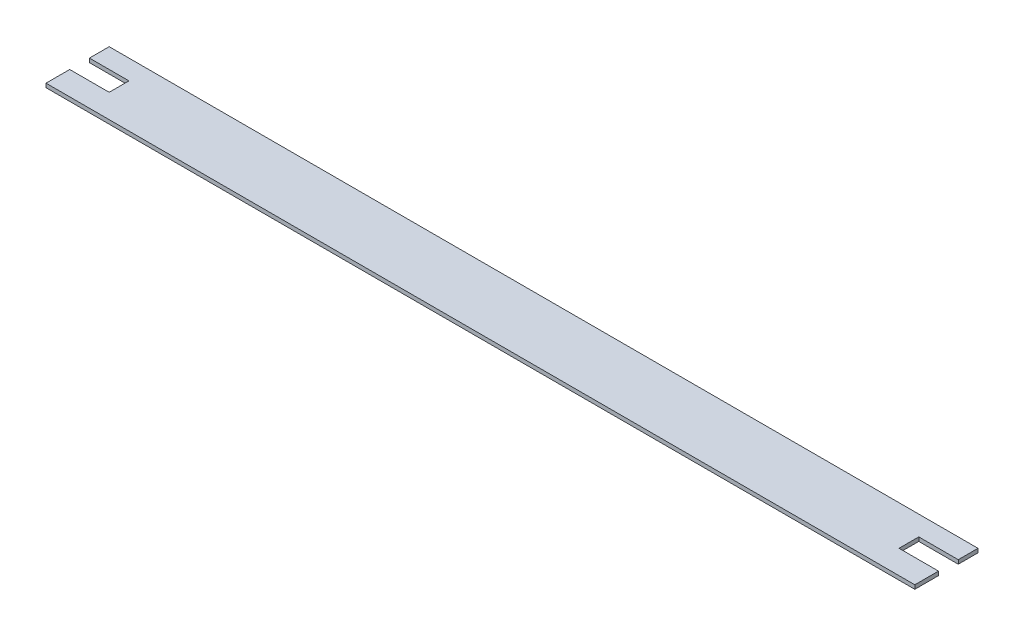
ISO-10303-21;
HEADER;
FILE_DESCRIPTION(('STEP AP214'),'2;1');
FILE_NAME('part.step','',(''),(''),'','','');
FILE_SCHEMA(('AUTOMOTIVE_DESIGN { 1 0 10303 214 1 1 1 1 }'));
ENDSEC;
DATA;
#1=APPLICATION_CONTEXT('core data for automotive mechanical design processes');
#2=APPLICATION_PROTOCOL_DEFINITION('international standard','automotive_design',2000,#1);
#3=PRODUCT_CONTEXT('',#1,'mechanical');
#4=PRODUCT('Part','Part','',(#3));
#5=PRODUCT_RELATED_PRODUCT_CATEGORY('part','',(#4));
#6=PRODUCT_DEFINITION_FORMATION('','',#4);
#7=PRODUCT_DEFINITION_CONTEXT('part definition',#1,'design');
#8=PRODUCT_DEFINITION('design','',#6,#7);
#9=PRODUCT_DEFINITION_SHAPE('','',#8);
#10=(LENGTH_UNIT() NAMED_UNIT(*) SI_UNIT(.MILLI.,.METRE.));
#11=(NAMED_UNIT(*) PLANE_ANGLE_UNIT() SI_UNIT($,.RADIAN.));
#12=(NAMED_UNIT(*) SI_UNIT($,.STERADIAN.) SOLID_ANGLE_UNIT());
#13=UNCERTAINTY_MEASURE_WITH_UNIT(LENGTH_MEASURE(1.E-05),#10,'distance_accuracy_value','');
#14=(GEOMETRIC_REPRESENTATION_CONTEXT(3) GLOBAL_UNCERTAINTY_ASSIGNED_CONTEXT((#13)) GLOBAL_UNIT_ASSIGNED_CONTEXT((#10,
#11,#12)) REPRESENTATION_CONTEXT('',''));
#15=CARTESIAN_POINT('',(0.,0.,0.));
#16=DIRECTION('',(0.,0.,1.));
#17=DIRECTION('',(1.,0.,0.));
#18=AXIS2_PLACEMENT_3D('',#15,#16,#17);
#19=CARTESIAN_POINT('',(597.266258042068,0.,0.));
#20=DIRECTION('',(-1.,0.,0.));
#21=DIRECTION('',(0.,0.,1.));
#22=AXIS2_PLACEMENT_3D('',#19,#20,#21);
#23=PLANE('',#22);
#24=DIRECTION('',(0.,0.,1.));
#25=VECTOR('',#24,1.);
#26=CARTESIAN_POINT('',(597.266258042068,-45.,0.));
#27=LINE('',#26,#25);
#28=CARTESIAN_POINT('',(597.266258042068,-45.,0.));
#29=VERTEX_POINT('',#28);
#30=CARTESIAN_POINT('',(597.266258042068,-45.,25.));
#31=VERTEX_POINT('',#30);
#32=EDGE_CURVE('E40',#29,#31,#27,.T.);
#33=ORIENTED_EDGE('',*,*,#32,.T.);
#34=DIRECTION('',(0.,1.,0.));
#35=VECTOR('',#34,1.);
#36=CARTESIAN_POINT('',(597.266258042068,-45.,25.));
#37=LINE('',#36,#35);
#38=CARTESIAN_POINT('',(597.266258042068,-50.,25.));
#39=VERTEX_POINT('',#38);
#40=EDGE_CURVE('E212',#39,#31,#37,.T.);
#41=ORIENTED_EDGE('',*,*,#40,.F.);
#42=DIRECTION('',(0.,0.,-1.));
#43=VECTOR('',#42,1.);
#44=CARTESIAN_POINT('',(597.266258042068,-50.,80.));
#45=LINE('',#44,#43);
#46=CARTESIAN_POINT('',(597.266258042068,-50.,0.));
#47=VERTEX_POINT('',#46);
#48=EDGE_CURVE('E11',#39,#47,#45,.T.);
#49=ORIENTED_EDGE('',*,*,#48,.T.);
#50=DIRECTION('',(0.,-1.,0.));
#51=VECTOR('',#50,1.);
#52=CARTESIAN_POINT('',(597.266258042068,0.,0.));
#53=LINE('',#52,#51);
#54=EDGE_CURVE('E35',#29,#47,#53,.T.);
#55=ORIENTED_EDGE('',*,*,#54,.F.);
#56=EDGE_LOOP('',(#33,#41,#49,#55));
#57=FACE_BOUND('',#56,.T.);
#58=ADVANCED_FACE('F32',(#57),#23,.F.);
#59=CARTESIAN_POINT('',(-502.733741957931,0.,0.));
#60=DIRECTION('',(1.,0.,0.));
#61=DIRECTION('',(0.,0.,-1.));
#62=AXIS2_PLACEMENT_3D('',#59,#60,#61);
#63=PLANE('',#62);
#64=DIRECTION('',(0.,0.,-1.));
#65=VECTOR('',#64,1.);
#66=CARTESIAN_POINT('',(-502.733741957931,-50.,80.));
#67=LINE('',#66,#65);
#68=CARTESIAN_POINT('',(-502.733741957931,-50.,25.));
#69=VERTEX_POINT('',#68);
#70=CARTESIAN_POINT('',(-502.733741957931,-50.,0.));
#71=VERTEX_POINT('',#70);
#72=EDGE_CURVE('E201',#69,#71,#67,.T.);
#73=ORIENTED_EDGE('',*,*,#72,.F.);
#74=DIRECTION('',(0.,-1.,0.));
#75=VECTOR('',#74,1.);
#76=CARTESIAN_POINT('',(-502.733741957931,-45.,25.));
#77=LINE('',#76,#75);
#78=CARTESIAN_POINT('',(-502.733741957931,-45.,25.));
#79=VERTEX_POINT('',#78);
#80=EDGE_CURVE('E163',#79,#69,#77,.T.);
#81=ORIENTED_EDGE('',*,*,#80,.F.);
#82=DIRECTION('',(0.,0.,-1.));
#83=VECTOR('',#82,1.);
#84=CARTESIAN_POINT('',(-502.733741957931,-45.,0.));
#85=LINE('',#84,#83);
#86=CARTESIAN_POINT('',(-502.733741957931,-45.,0.));
#87=VERTEX_POINT('',#86);
#88=EDGE_CURVE('E206',#79,#87,#85,.T.);
#89=ORIENTED_EDGE('',*,*,#88,.T.);
#90=DIRECTION('',(0.,1.,0.));
#91=VECTOR('',#90,1.);
#92=CARTESIAN_POINT('',(-502.733741957931,0.,0.));
#93=LINE('',#92,#91);
#94=EDGE_CURVE('E203',#71,#87,#93,.T.);
#95=ORIENTED_EDGE('',*,*,#94,.F.);
#96=EDGE_LOOP('',(#73,#81,#89,#95));
#97=FACE_BOUND('',#96,.T.);
#98=ADVANCED_FACE('F227',(#97),#63,.F.);
#99=CARTESIAN_POINT('',(0.,-45.,0.));
#100=DIRECTION('',(0.,1.,0.));
#101=DIRECTION('',(0.,0.,1.));
#102=AXIS2_PLACEMENT_3D('',#99,#100,#101);
#103=PLANE('',#102);
#104=ORIENTED_EDGE('',*,*,#32,.F.);
#105=DIRECTION('',(-1.,0.,0.));
#106=VECTOR('',#105,1.);
#107=CARTESIAN_POINT('',(-502.733741957931,-45.,0.));
#108=LINE('',#107,#106);
#109=EDGE_CURVE('E185',#29,#87,#108,.T.);
#110=ORIENTED_EDGE('',*,*,#109,.T.);
#111=ORIENTED_EDGE('',*,*,#88,.F.);
#112=DIRECTION('',(-1.,0.,0.));
#113=VECTOR('',#112,1.);
#114=CARTESIAN_POINT('',(-452.733741957932,-45.,25.));
#115=LINE('',#114,#113);
#116=CARTESIAN_POINT('',(-452.733741957932,-45.,25.));
#117=VERTEX_POINT('',#116);
#118=EDGE_CURVE('E167',#117,#79,#115,.T.);
#119=ORIENTED_EDGE('',*,*,#118,.F.);
#120=DIRECTION('',(0.,0.,-1.));
#121=VECTOR('',#120,1.);
#122=CARTESIAN_POINT('',(-452.733741957932,-45.,25.));
#123=LINE('',#122,#121);
#124=CARTESIAN_POINT('',(-452.733741957932,-45.,50.));
#125=VERTEX_POINT('',#124);
#126=EDGE_CURVE('E159',#125,#117,#123,.T.);
#127=ORIENTED_EDGE('',*,*,#126,.F.);
#128=DIRECTION('',(-1.,0.,0.));
#129=VECTOR('',#128,1.);
#130=CARTESIAN_POINT('',(-452.733741957932,-45.,50.));
#131=LINE('',#130,#129);
#132=CARTESIAN_POINT('',(-502.733741957931,-45.,50.));
#133=VERTEX_POINT('',#132);
#134=EDGE_CURVE('E171',#125,#133,#131,.T.);
#135=ORIENTED_EDGE('',*,*,#134,.T.);
#136=DIRECTION('',(0.,0.,1.));
#137=VECTOR('',#136,1.);
#138=CARTESIAN_POINT('',(-502.733741957931,-45.,80.));
#139=LINE('',#138,#137);
#140=CARTESIAN_POINT('',(-502.733741957931,-45.,80.));
#141=VERTEX_POINT('',#140);
#142=EDGE_CURVE('E170',#141,#133,#139,.F.);
#143=ORIENTED_EDGE('',*,*,#142,.F.);
#144=DIRECTION('',(1.,0.,0.));
#145=VECTOR('',#144,1.);
#146=CARTESIAN_POINT('',(-502.733741957931,-45.,80.));
#147=LINE('',#146,#145);
#148=CARTESIAN_POINT('',(597.266258042068,-45.,80.));
#149=VERTEX_POINT('',#148);
#150=EDGE_CURVE('E181',#141,#149,#147,.T.);
#151=ORIENTED_EDGE('',*,*,#150,.T.);
#152=DIRECTION('',(0.,0.,-1.));
#153=VECTOR('',#152,1.);
#154=CARTESIAN_POINT('',(597.266258042068,-45.,80.));
#155=LINE('',#154,#153);
#156=CARTESIAN_POINT('',(597.266258042068,-45.,50.));
#157=VERTEX_POINT('',#156);
#158=EDGE_CURVE('E142',#149,#157,#155,.T.);
#159=ORIENTED_EDGE('',*,*,#158,.T.);
#160=DIRECTION('',(1.,0.,0.));
#161=VECTOR('',#160,1.);
#162=CARTESIAN_POINT('',(547.266258042068,-45.,50.));
#163=LINE('',#162,#161);
#164=CARTESIAN_POINT('',(547.266258042068,-45.,50.));
#165=VERTEX_POINT('',#164);
#166=EDGE_CURVE('E122',#165,#157,#163,.T.);
#167=ORIENTED_EDGE('',*,*,#166,.F.);
#168=DIRECTION('',(0.,0.,1.));
#169=VECTOR('',#168,1.);
#170=CARTESIAN_POINT('',(547.266258042068,-45.,25.));
#171=LINE('',#170,#169);
#172=CARTESIAN_POINT('',(547.266258042068,-45.,25.));
#173=VERTEX_POINT('',#172);
#174=EDGE_CURVE('E130',#173,#165,#171,.T.);
#175=ORIENTED_EDGE('',*,*,#174,.F.);
#176=DIRECTION('',(1.,0.,0.));
#177=VECTOR('',#176,1.);
#178=CARTESIAN_POINT('',(547.266258042068,-45.,25.));
#179=LINE('',#178,#177);
#180=EDGE_CURVE('E143',#173,#31,#179,.T.);
#181=ORIENTED_EDGE('',*,*,#180,.T.);
#182=EDGE_LOOP('',(#104,#110,#111,#119,#127,#135,#143,#151,#159,#167,#175,#181));
#183=FACE_BOUND('',#182,.T.);
#184=ADVANCED_FACE('F140',(#183),#103,.T.);
#185=CARTESIAN_POINT('',(-502.733741957931,0.,0.));
#186=DIRECTION('',(0.,0.,1.));
#187=DIRECTION('',(1.,0.,0.));
#188=AXIS2_PLACEMENT_3D('',#185,#186,#187);
#189=PLANE('',#188);
#190=ORIENTED_EDGE('',*,*,#109,.F.);
#191=ORIENTED_EDGE('',*,*,#54,.T.);
#192=DIRECTION('',(1.,0.,0.));
#193=VECTOR('',#192,1.);
#194=CARTESIAN_POINT('',(-502.733741957931,-50.,0.));
#195=LINE('',#194,#193);
#196=EDGE_CURVE('E198',#71,#47,#195,.T.);
#197=ORIENTED_EDGE('',*,*,#196,.F.);
#198=ORIENTED_EDGE('',*,*,#94,.T.);
#199=EDGE_LOOP('',(#190,#191,#197,#198));
#200=FACE_BOUND('',#199,.T.);
#201=ADVANCED_FACE('F224',(#200),#189,.F.);
#202=CARTESIAN_POINT('',(-502.733741957931,-50.,80.));
#203=DIRECTION('',(0.,1.,0.));
#204=DIRECTION('',(0.,0.,1.));
#205=AXIS2_PLACEMENT_3D('',#202,#203,#204);
#206=PLANE('',#205);
#207=ORIENTED_EDGE('',*,*,#48,.F.);
#208=DIRECTION('',(1.,0.,0.));
#209=VECTOR('',#208,1.);
#210=CARTESIAN_POINT('',(547.266258042068,-50.,25.));
#211=LINE('',#210,#209);
#212=CARTESIAN_POINT('',(547.266258042068,-50.,25.));
#213=VERTEX_POINT('',#212);
#214=EDGE_CURVE('E145',#213,#39,#211,.T.);
#215=ORIENTED_EDGE('',*,*,#214,.F.);
#216=DIRECTION('',(0.,0.,-1.));
#217=VECTOR('',#216,1.);
#218=CARTESIAN_POINT('',(547.266258042068,-50.,25.));
#219=LINE('',#218,#217);
#220=CARTESIAN_POINT('',(547.266258042068,-50.,50.));
#221=VERTEX_POINT('',#220);
#222=EDGE_CURVE('E129',#221,#213,#219,.T.);
#223=ORIENTED_EDGE('',*,*,#222,.F.);
#224=DIRECTION('',(1.,0.,0.));
#225=VECTOR('',#224,1.);
#226=CARTESIAN_POINT('',(547.266258042068,-50.,50.));
#227=LINE('',#226,#225);
#228=CARTESIAN_POINT('',(597.266258042068,-50.,50.));
#229=VERTEX_POINT('',#228);
#230=EDGE_CURVE('E125',#221,#229,#227,.T.);
#231=ORIENTED_EDGE('',*,*,#230,.T.);
#232=DIRECTION('',(0.,0.,-1.));
#233=VECTOR('',#232,1.);
#234=CARTESIAN_POINT('',(597.266258042068,-50.,80.));
#235=LINE('',#234,#233);
#236=CARTESIAN_POINT('',(597.266258042068,-50.,80.));
#237=VERTEX_POINT('',#236);
#238=EDGE_CURVE('E182',#237,#229,#235,.T.);
#239=ORIENTED_EDGE('',*,*,#238,.F.);
#240=DIRECTION('',(1.,0.,0.));
#241=VECTOR('',#240,1.);
#242=CARTESIAN_POINT('',(-502.733741957931,-50.,80.));
#243=LINE('',#242,#241);
#244=CARTESIAN_POINT('',(-502.733741957931,-50.,80.));
#245=VERTEX_POINT('',#244);
#246=EDGE_CURVE('E191',#245,#237,#243,.T.);
#247=ORIENTED_EDGE('',*,*,#246,.F.);
#248=DIRECTION('',(0.,0.,-1.));
#249=VECTOR('',#248,1.);
#250=CARTESIAN_POINT('',(-502.733741957931,-50.,80.));
#251=LINE('',#250,#249);
#252=CARTESIAN_POINT('',(-502.733741957931,-50.,50.));
#253=VERTEX_POINT('',#252);
#254=EDGE_CURVE('E189',#245,#253,#251,.T.);
#255=ORIENTED_EDGE('',*,*,#254,.T.);
#256=DIRECTION('',(-1.,0.,0.));
#257=VECTOR('',#256,1.);
#258=CARTESIAN_POINT('',(-452.733741957932,-50.,50.));
#259=LINE('',#258,#257);
#260=CARTESIAN_POINT('',(-452.733741957932,-50.,50.));
#261=VERTEX_POINT('',#260);
#262=EDGE_CURVE('E174',#261,#253,#259,.T.);
#263=ORIENTED_EDGE('',*,*,#262,.F.);
#264=DIRECTION('',(0.,0.,1.));
#265=VECTOR('',#264,1.);
#266=CARTESIAN_POINT('',(-452.733741957932,-50.,25.));
#267=LINE('',#266,#265);
#268=CARTESIAN_POINT('',(-452.733741957932,-50.,25.));
#269=VERTEX_POINT('',#268);
#270=EDGE_CURVE('E153',#269,#261,#267,.T.);
#271=ORIENTED_EDGE('',*,*,#270,.F.);
#272=DIRECTION('',(-1.,0.,0.));
#273=VECTOR('',#272,1.);
#274=CARTESIAN_POINT('',(-452.733741957932,-50.,25.));
#275=LINE('',#274,#273);
#276=EDGE_CURVE('E162',#269,#69,#275,.T.);
#277=ORIENTED_EDGE('',*,*,#276,.T.);
#278=ORIENTED_EDGE('',*,*,#72,.T.);
#279=ORIENTED_EDGE('',*,*,#196,.T.);
#280=EDGE_LOOP('',(#207,#215,#223,#231,#239,#247,#255,#263,#271,#277,#278,#279));
#281=FACE_BOUND('',#280,.T.);
#282=ADVANCED_FACE('F223',(#281),#206,.F.);
#283=CARTESIAN_POINT('',(-502.733741957931,0.,80.));
#284=DIRECTION('',(0.,0.,1.));
#285=DIRECTION('',(1.,0.,0.));
#286=AXIS2_PLACEMENT_3D('',#283,#284,#285);
#287=PLANE('',#286);
#288=DIRECTION('',(0.,1.,0.));
#289=VECTOR('',#288,1.);
#290=CARTESIAN_POINT('',(-502.733741957931,0.,80.));
#291=LINE('',#290,#289);
#292=EDGE_CURVE('E178',#245,#141,#291,.T.);
#293=ORIENTED_EDGE('',*,*,#292,.F.);
#294=ORIENTED_EDGE('',*,*,#246,.T.);
#295=DIRECTION('',(0.,1.,0.));
#296=VECTOR('',#295,1.);
#297=CARTESIAN_POINT('',(597.266258042068,0.,80.));
#298=LINE('',#297,#296);
#299=EDGE_CURVE('E186',#237,#149,#298,.T.);
#300=ORIENTED_EDGE('',*,*,#299,.T.);
#301=ORIENTED_EDGE('',*,*,#150,.F.);
#302=EDGE_LOOP('',(#293,#294,#300,#301));
#303=FACE_BOUND('',#302,.T.);
#304=ADVANCED_FACE('F244',(#303),#287,.T.);
#305=ORIENTED_EDGE('',*,*,#142,.T.);
#306=DIRECTION('',(0.,1.,0.));
#307=VECTOR('',#306,1.);
#308=CARTESIAN_POINT('',(-502.733741957931,-45.,50.));
#309=LINE('',#308,#307);
#310=EDGE_CURVE('E154',#253,#133,#309,.T.);
#311=ORIENTED_EDGE('',*,*,#310,.F.);
#312=ORIENTED_EDGE('',*,*,#254,.F.);
#313=ORIENTED_EDGE('',*,*,#292,.T.);
#314=EDGE_LOOP('',(#305,#311,#312,#313));
#315=FACE_BOUND('',#314,.T.);
#316=ADVANCED_FACE('F239',(#315),#63,.F.);
#317=CARTESIAN_POINT('',(597.266258042068,0.,0.));
#318=DIRECTION('',(1.,0.,0.));
#319=DIRECTION('',(0.,0.,-1.));
#320=AXIS2_PLACEMENT_3D('',#317,#318,#319);
#321=PLANE('',#320);
#322=DIRECTION('',(0.,-1.,0.));
#323=VECTOR('',#322,1.);
#324=CARTESIAN_POINT('',(597.266258042068,-45.,50.));
#325=LINE('',#324,#323);
#326=EDGE_CURVE('E217',#157,#229,#325,.T.);
#327=ORIENTED_EDGE('',*,*,#326,.F.);
#328=ORIENTED_EDGE('',*,*,#158,.F.);
#329=ORIENTED_EDGE('',*,*,#299,.F.);
#330=ORIENTED_EDGE('',*,*,#238,.T.);
#331=EDGE_LOOP('',(#327,#328,#329,#330));
#332=FACE_BOUND('',#331,.T.);
#333=ADVANCED_FACE('F248',(#332),#321,.T.);
#334=CARTESIAN_POINT('',(-452.733741957932,-45.,25.));
#335=DIRECTION('',(0.,0.,-1.));
#336=DIRECTION('',(-1.,0.,0.));
#337=AXIS2_PLACEMENT_3D('',#334,#335,#336);
#338=PLANE('',#337);
#339=ORIENTED_EDGE('',*,*,#80,.T.);
#340=ORIENTED_EDGE('',*,*,#276,.F.);
#341=DIRECTION('',(0.,-1.,0.));
#342=VECTOR('',#341,1.);
#343=CARTESIAN_POINT('',(-452.733741957932,-45.,25.));
#344=LINE('',#343,#342);
#345=EDGE_CURVE('E150',#117,#269,#344,.T.);
#346=ORIENTED_EDGE('',*,*,#345,.F.);
#347=ORIENTED_EDGE('',*,*,#118,.T.);
#348=EDGE_LOOP('',(#339,#340,#346,#347));
#349=FACE_BOUND('',#348,.T.);
#350=ADVANCED_FACE('F231',(#349),#338,.F.);
#351=CARTESIAN_POINT('',(-452.733741957932,-45.,50.));
#352=DIRECTION('',(0.,0.,1.));
#353=DIRECTION('',(1.,0.,0.));
#354=AXIS2_PLACEMENT_3D('',#351,#352,#353);
#355=PLANE('',#354);
#356=ORIENTED_EDGE('',*,*,#310,.T.);
#357=ORIENTED_EDGE('',*,*,#134,.F.);
#358=DIRECTION('',(0.,1.,0.));
#359=VECTOR('',#358,1.);
#360=CARTESIAN_POINT('',(-452.733741957932,-45.,50.));
#361=LINE('',#360,#359);
#362=EDGE_CURVE('E157',#261,#125,#361,.T.);
#363=ORIENTED_EDGE('',*,*,#362,.F.);
#364=ORIENTED_EDGE('',*,*,#262,.T.);
#365=EDGE_LOOP('',(#356,#357,#363,#364));
#366=FACE_BOUND('',#365,.T.);
#367=ADVANCED_FACE('F250',(#366),#355,.F.);
#368=CARTESIAN_POINT('',(-452.733741957932,0.,0.));
#369=DIRECTION('',(-1.,0.,0.));
#370=DIRECTION('',(0.,0.,1.));
#371=AXIS2_PLACEMENT_3D('',#368,#369,#370);
#372=PLANE('',#371);
#373=ORIENTED_EDGE('',*,*,#345,.T.);
#374=ORIENTED_EDGE('',*,*,#270,.T.);
#375=ORIENTED_EDGE('',*,*,#362,.T.);
#376=ORIENTED_EDGE('',*,*,#126,.T.);
#377=EDGE_LOOP('',(#373,#374,#375,#376));
#378=FACE_BOUND('',#377,.T.);
#379=ADVANCED_FACE('F234',(#378),#372,.T.);
#380=CARTESIAN_POINT('',(547.266258042068,-45.,25.));
#381=DIRECTION('',(0.,0.,-1.));
#382=DIRECTION('',(-1.,0.,0.));
#383=AXIS2_PLACEMENT_3D('',#380,#381,#382);
#384=PLANE('',#383);
#385=ORIENTED_EDGE('',*,*,#40,.T.);
#386=ORIENTED_EDGE('',*,*,#180,.F.);
#387=DIRECTION('',(0.,1.,0.));
#388=VECTOR('',#387,1.);
#389=CARTESIAN_POINT('',(547.266258042068,-45.,25.));
#390=LINE('',#389,#388);
#391=EDGE_CURVE('E134',#213,#173,#390,.T.);
#392=ORIENTED_EDGE('',*,*,#391,.F.);
#393=ORIENTED_EDGE('',*,*,#214,.T.);
#394=EDGE_LOOP('',(#385,#386,#392,#393));
#395=FACE_BOUND('',#394,.T.);
#396=ADVANCED_FACE('F215',(#395),#384,.F.);
#397=CARTESIAN_POINT('',(547.266258042068,-45.,50.));
#398=DIRECTION('',(0.,0.,1.));
#399=DIRECTION('',(0.,-1.,0.));
#400=AXIS2_PLACEMENT_3D('',#397,#398,#399);
#401=PLANE('',#400);
#402=ORIENTED_EDGE('',*,*,#326,.T.);
#403=ORIENTED_EDGE('',*,*,#230,.F.);
#404=DIRECTION('',(0.,-1.,0.));
#405=VECTOR('',#404,1.);
#406=CARTESIAN_POINT('',(547.266258042068,-45.,50.));
#407=LINE('',#406,#405);
#408=EDGE_CURVE('E118',#165,#221,#407,.T.);
#409=ORIENTED_EDGE('',*,*,#408,.F.);
#410=ORIENTED_EDGE('',*,*,#166,.T.);
#411=EDGE_LOOP('',(#402,#403,#409,#410));
#412=FACE_BOUND('',#411,.T.);
#413=ADVANCED_FACE('F120',(#412),#401,.F.);
#414=CARTESIAN_POINT('',(547.266258042068,0.,0.));
#415=DIRECTION('',(-1.,0.,0.));
#416=DIRECTION('',(0.,0.,1.));
#417=AXIS2_PLACEMENT_3D('',#414,#415,#416);
#418=PLANE('',#417);
#419=ORIENTED_EDGE('',*,*,#391,.T.);
#420=ORIENTED_EDGE('',*,*,#174,.T.);
#421=ORIENTED_EDGE('',*,*,#408,.T.);
#422=ORIENTED_EDGE('',*,*,#222,.T.);
#423=EDGE_LOOP('',(#419,#420,#421,#422));
#424=FACE_BOUND('',#423,.T.);
#425=ADVANCED_FACE('F133',(#424),#418,.F.);
#426=CLOSED_SHELL('',(#58,#98,#184,#201,#282,#304,#316,#333,#350,#367,#379,#396,#413,#425));
#427=MANIFOLD_SOLID_BREP('B2',#426);
#428=ADVANCED_BREP_SHAPE_REPRESENTATION('',(#18,#427),#14);
#429=SHAPE_DEFINITION_REPRESENTATION(#9,#428);
ENDSEC;
END-ISO-10303-21;
